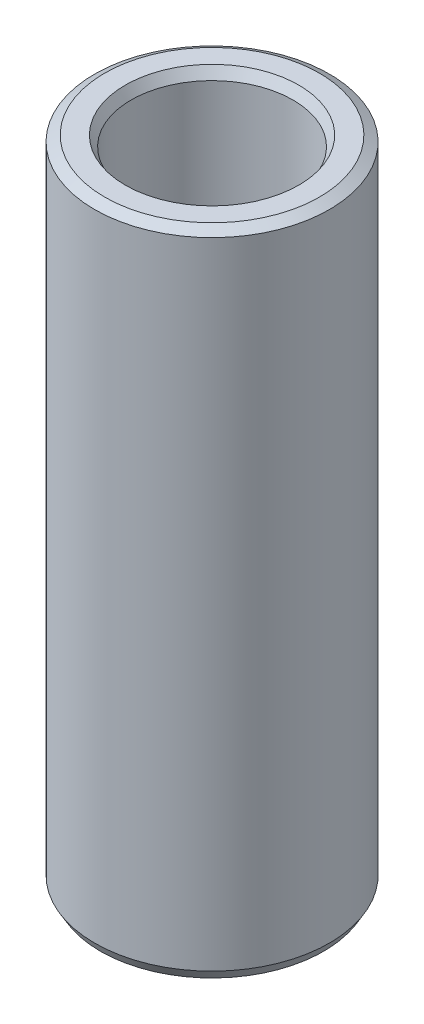
ISO-10303-21;
HEADER;
FILE_DESCRIPTION(('STEP AP214'),'2;1');
FILE_NAME('part.step','',(''),(''),'','','');
FILE_SCHEMA(('AUTOMOTIVE_DESIGN { 1 0 10303 214 1 1 1 1 }'));
ENDSEC;
DATA;
#1=APPLICATION_CONTEXT('core data for automotive mechanical design processes');
#2=APPLICATION_PROTOCOL_DEFINITION('international standard','automotive_design',2000,#1);
#3=PRODUCT_CONTEXT('',#1,'mechanical');
#4=PRODUCT('Part','Part','',(#3));
#5=PRODUCT_RELATED_PRODUCT_CATEGORY('part','',(#4));
#6=PRODUCT_DEFINITION_FORMATION('','',#4);
#7=PRODUCT_DEFINITION_CONTEXT('part definition',#1,'design');
#8=PRODUCT_DEFINITION('design','',#6,#7);
#9=PRODUCT_DEFINITION_SHAPE('','',#8);
#10=(LENGTH_UNIT() NAMED_UNIT(*) SI_UNIT(.MILLI.,.METRE.));
#11=(NAMED_UNIT(*) PLANE_ANGLE_UNIT() SI_UNIT($,.RADIAN.));
#12=(NAMED_UNIT(*) SI_UNIT($,.STERADIAN.) SOLID_ANGLE_UNIT());
#13=UNCERTAINTY_MEASURE_WITH_UNIT(LENGTH_MEASURE(1.E-05),#10,'distance_accuracy_value','');
#14=(GEOMETRIC_REPRESENTATION_CONTEXT(3) GLOBAL_UNCERTAINTY_ASSIGNED_CONTEXT((#13)) GLOBAL_UNIT_ASSIGNED_CONTEXT((#10,
#11,#12)) REPRESENTATION_CONTEXT('',''));
#15=CARTESIAN_POINT('',(0.,0.,0.));
#16=DIRECTION('',(0.,0.,1.));
#17=DIRECTION('',(1.,0.,0.));
#18=AXIS2_PLACEMENT_3D('',#15,#16,#17);
#19=CARTESIAN_POINT('',(0.,318.869293218978,0.));
#20=DIRECTION('',(0.,-1.,0.));
#21=DIRECTION('',(0.,0.,-1.));
#22=AXIS2_PLACEMENT_3D('',#19,#20,#21);
#23=CYLINDRICAL_SURFACE('',#22,57.5);
#24=CARTESIAN_POINT('',(0.,4.9073877199623,0.));
#25=DIRECTION('',(0.,1.,0.));
#26=DIRECTION('',(0.,0.,1.));
#27=AXIS2_PLACEMENT_3D('',#24,#25,#26);
#28=CIRCLE('',#27,57.5);
#29=CARTESIAN_POINT('',(0.,4.9073877199623,57.5));
#30=VERTEX_POINT('',#29);
#31=EDGE_CURVE('E10',#30,#30,#28,.T.);
#32=ORIENTED_EDGE('',*,*,#31,.T.);
#33=EDGE_LOOP('',(#32));
#34=FACE_BOUND('',#33,.T.);
#35=CARTESIAN_POINT('',(0.,316.03601159784,0.));
#36=DIRECTION('',(0.,1.,0.));
#37=DIRECTION('',(0.,0.,1.));
#38=AXIS2_PLACEMENT_3D('',#35,#36,#37);
#39=CIRCLE('',#38,57.5);
#40=CARTESIAN_POINT('',(0.,316.03601159784,57.5));
#41=VERTEX_POINT('',#40);
#42=EDGE_CURVE('E50',#41,#41,#39,.F.);
#43=ORIENTED_EDGE('',*,*,#42,.T.);
#44=EDGE_LOOP('',(#43));
#45=FACE_BOUND('',#44,.T.);
#46=ADVANCED_FACE('F39',(#34,#45),#23,.T.);
#47=CARTESIAN_POINT('',(0.,318.869293218978,0.));
#48=DIRECTION('',(0.,1.,0.));
#49=DIRECTION('',(0.,0.,1.));
#50=AXIS2_PLACEMENT_3D('',#47,#48,#49);
#51=PLANE('',#50);
#52=CARTESIAN_POINT('',(0.,318.869293218978,0.));
#53=DIRECTION('',(0.,1.,0.));
#54=DIRECTION('',(0.,0.,1.));
#55=AXIS2_PLACEMENT_3D('',#52,#53,#54);
#56=CIRCLE('',#55,42.4833806320961);
#57=CARTESIAN_POINT('',(0.,318.869293218978,42.4833806320961));
#58=VERTEX_POINT('',#57);
#59=EDGE_CURVE('E58',#58,#58,#56,.F.);
#60=ORIENTED_EDGE('',*,*,#59,.T.);
#61=EDGE_LOOP('',(#60));
#62=FACE_BOUND('',#61,.T.);
#63=CARTESIAN_POINT('',(0.,318.869293218978,0.));
#64=DIRECTION('',(0.,1.,0.));
#65=DIRECTION('',(0.,0.,1.));
#66=AXIS2_PLACEMENT_3D('',#63,#64,#65);
#67=CIRCLE('',#66,52.5926122800376);
#68=CARTESIAN_POINT('',(0.,318.869293218978,52.5926122800376));
#69=VERTEX_POINT('',#68);
#70=EDGE_CURVE('E61',#69,#69,#67,.T.);
#71=ORIENTED_EDGE('',*,*,#70,.T.);
#72=EDGE_LOOP('',(#71));
#73=FACE_BOUND('',#72,.T.);
#74=ADVANCED_FACE('F88',(#62,#73),#51,.T.);
#75=CARTESIAN_POINT('',(0.,0.,0.));
#76=DIRECTION('',(0.,1.,0.));
#77=DIRECTION('',(0.,0.,1.));
#78=AXIS2_PLACEMENT_3D('',#75,#76,#77);
#79=PLANE('',#78);
#80=CARTESIAN_POINT('',(0.,0.,0.));
#81=DIRECTION('',(0.,1.,0.));
#82=DIRECTION('',(0.,0.,1.));
#83=AXIS2_PLACEMENT_3D('',#80,#81,#82);
#84=CIRCLE('',#83,44.5574867309204);
#85=CARTESIAN_POINT('',(0.,0.,-44.5574867309204));
#86=VERTEX_POINT('',#85);
#87=EDGE_CURVE('E51',#86,#86,#84,.T.);
#88=ORIENTED_EDGE('',*,*,#87,.T.);
#89=EDGE_LOOP('',(#88));
#90=FACE_BOUND('',#89,.T.);
#91=CARTESIAN_POINT('',(0.,0.,0.));
#92=DIRECTION('',(0.,1.,0.));
#93=DIRECTION('',(0.,0.,1.));
#94=AXIS2_PLACEMENT_3D('',#91,#92,#93);
#95=CIRCLE('',#94,54.6667183788619);
#96=CARTESIAN_POINT('',(0.,0.,54.6667183788619));
#97=VERTEX_POINT('',#96);
#98=EDGE_CURVE('E54',#97,#97,#95,.F.);
#99=ORIENTED_EDGE('',*,*,#98,.T.);
#100=EDGE_LOOP('',(#99));
#101=FACE_BOUND('',#100,.T.);
#102=ADVANCED_FACE('F83',(#90,#101),#79,.F.);
#103=CARTESIAN_POINT('',(0.,318.869293218978,0.));
#104=DIRECTION('',(0.,-1.,0.));
#105=DIRECTION('',(0.,0.,-1.));
#106=AXIS2_PLACEMENT_3D('',#103,#104,#105);
#107=CYLINDRICAL_SURFACE('',#106,39.650099010958);
#108=CARTESIAN_POINT('',(0.,313.961905499016,0.));
#109=DIRECTION('',(0.,1.,0.));
#110=DIRECTION('',(0.,0.,1.));
#111=AXIS2_PLACEMENT_3D('',#108,#109,#110);
#112=CIRCLE('',#111,39.650099010958);
#113=CARTESIAN_POINT('',(0.,313.961905499016,39.650099010958));
#114=VERTEX_POINT('',#113);
#115=EDGE_CURVE('E67',#114,#114,#112,.T.);
#116=ORIENTED_EDGE('',*,*,#115,.T.);
#117=EDGE_LOOP('',(#116));
#118=FACE_BOUND('',#117,.T.);
#119=CARTESIAN_POINT('',(0.,2.83328162113811,0.));
#120=DIRECTION('',(0.,1.,0.));
#121=DIRECTION('',(0.,0.,1.));
#122=AXIS2_PLACEMENT_3D('',#119,#120,#121);
#123=CIRCLE('',#122,39.650099010958);
#124=CARTESIAN_POINT('',(0.,2.83328162113811,-39.650099010958));
#125=VERTEX_POINT('',#124);
#126=EDGE_CURVE('E69',#125,#125,#123,.F.);
#127=ORIENTED_EDGE('',*,*,#126,.T.);
#128=EDGE_LOOP('',(#127));
#129=FACE_BOUND('',#128,.T.);
#130=ADVANCED_FACE('F71',(#118,#129),#107,.F.);
#131=CARTESIAN_POINT('',(0.,313.961905499016,0.));
#132=DIRECTION('',(0.,1.,0.));
#133=DIRECTION('',(0.,0.,1.));
#134=AXIS2_PLACEMENT_3D('',#131,#132,#133);
#135=CONICAL_SURFACE('',#134,39.650099010958,0.523598775598301);
#136=ORIENTED_EDGE('',*,*,#59,.F.);
#137=EDGE_LOOP('',(#136));
#138=FACE_BOUND('',#137,.T.);
#139=ORIENTED_EDGE('',*,*,#115,.F.);
#140=EDGE_LOOP('',(#139));
#141=FACE_BOUND('',#140,.T.);
#142=ADVANCED_FACE('F77',(#138,#141),#135,.F.);
#143=CARTESIAN_POINT('',(0.,0.,0.));
#144=DIRECTION('',(0.,-1.,0.));
#145=DIRECTION('',(0.,0.,-1.));
#146=AXIS2_PLACEMENT_3D('',#143,#144,#145);
#147=CONICAL_SURFACE('',#146,44.5574867309204,1.0471975511966);
#148=CARTESIAN_POINT('',(0.,2.83328162113811,-39.650099010958));
#149=CARTESIAN_POINT('',(0.,2.80376827091792,-39.701217633041));
#150=CARTESIAN_POINT('',(0.,2.77425492069773,-39.7523362551239));
#151=CARTESIAN_POINT('',(0.,2.71522822025735,-39.8545734992898));
#152=CARTESIAN_POINT('',(0.,2.68571487003716,-39.9056921213727));
#153=CARTESIAN_POINT('',(0.,2.62668816959679,-40.0079293655386));
#154=CARTESIAN_POINT('',(0.,2.5971748193766,-40.0590479876216));
#155=CARTESIAN_POINT('',(0.,2.53814811893622,-40.1612852317874));
#156=CARTESIAN_POINT('',(0.,2.50863476871603,-40.2124038538704));
#157=CARTESIAN_POINT('',(0.,2.44960806827565,-40.3146410980363));
#158=CARTESIAN_POINT('',(0.,2.42009471805547,-40.3657597201192));
#159=CARTESIAN_POINT('',(0.,2.36106801761509,-40.4679969642851));
#160=CARTESIAN_POINT('',(0.,2.3315546673949,-40.519115586368));
#161=CARTESIAN_POINT('',(0.,2.27252796695452,-40.6213528305339));
#162=CARTESIAN_POINT('',(0.,2.24301461673433,-40.6724714526168));
#163=CARTESIAN_POINT('',(0.,2.18398791629396,-40.7747086967827));
#164=CARTESIAN_POINT('',(0.,2.15447456607377,-40.8258273188657));
#165=CARTESIAN_POINT('',(0.,2.09544786563339,-40.9280645630316));
#166=CARTESIAN_POINT('',(0.,2.0659345154132,-40.9791831851145));
#167=CARTESIAN_POINT('',(0.,2.00690781497282,-41.0814204292804));
#168=CARTESIAN_POINT('',(0.,1.97739446475264,-41.1325390513633));
#169=CARTESIAN_POINT('',(0.,1.91836776431226,-41.2347762955292));
#170=CARTESIAN_POINT('',(0.,1.88885441409207,-41.2858949176121));
#171=CARTESIAN_POINT('',(0.,1.82982771365169,-41.388132161778));
#172=CARTESIAN_POINT('',(0.,1.8003143634315,-41.439250783861));
#173=CARTESIAN_POINT('',(0.,1.74128766299113,-41.5414880280268));
#174=CARTESIAN_POINT('',(0.,1.71177431277094,-41.5926066501098));
#175=CARTESIAN_POINT('',(0.,1.65274761233056,-41.6948438942757));
#176=CARTESIAN_POINT('',(0.,1.62323426211037,-41.7459625163586));
#177=CARTESIAN_POINT('',(0.,1.56420756167,-41.8481997605245));
#178=CARTESIAN_POINT('',(0.,1.53469421144981,-41.8993183826074));
#179=CARTESIAN_POINT('',(0.,1.47566751100943,-42.0015556267733));
#180=CARTESIAN_POINT('',(0.,1.44615416078924,-42.0526742488563));
#181=CARTESIAN_POINT('',(0.,1.38712746034886,-42.1549114930221));
#182=CARTESIAN_POINT('',(0.,1.35761411012868,-42.2060301151051));
#183=CARTESIAN_POINT('',(0.,1.2985874096883,-42.308267359271));
#184=CARTESIAN_POINT('',(0.,1.26907405946811,-42.3593859813539));
#185=CARTESIAN_POINT('',(0.,1.21004735902773,-42.4616232255198));
#186=CARTESIAN_POINT('',(0.,1.18053400880754,-42.5127418476027));
#187=CARTESIAN_POINT('',(0.,1.12150730836717,-42.6149790917686));
#188=CARTESIAN_POINT('',(0.,1.09199395814698,-42.6660977138515));
#189=CARTESIAN_POINT('',(0.,1.0329672577066,-42.7683349580174));
#190=CARTESIAN_POINT('',(0.,1.00345390748641,-42.8194535801004));
#191=CARTESIAN_POINT('',(0.,0.944427207046035,-42.9216908242662));
#192=CARTESIAN_POINT('',(0.,0.914913856825847,-42.9728094463492));
#193=CARTESIAN_POINT('',(0.,0.85588715638547,-43.0750466905151));
#194=CARTESIAN_POINT('',(0.,0.826373806165281,-43.126165312598));
#195=CARTESIAN_POINT('',(0.,0.767347105724904,-43.2284025567639));
#196=CARTESIAN_POINT('',(0.,0.737833755504715,-43.2795211788468));
#197=CARTESIAN_POINT('',(0.,0.678807055064338,-43.3817584230127));
#198=CARTESIAN_POINT('',(0.,0.649293704844149,-43.4328770450957));
#199=CARTESIAN_POINT('',(0.,0.590267004403772,-43.5351142892615));
#200=CARTESIAN_POINT('',(0.,0.560753654183584,-43.5862329113445));
#201=CARTESIAN_POINT('',(0.,0.501726953743207,-43.6884701555104));
#202=CARTESIAN_POINT('',(0.,0.472213603523017,-43.7395887775933));
#203=CARTESIAN_POINT('',(0.,0.41318690308264,-43.8418260217592));
#204=CARTESIAN_POINT('',(0.,0.383673552862452,-43.8929446438421));
#205=CARTESIAN_POINT('',(0.,0.324646852422075,-43.995181888008));
#206=CARTESIAN_POINT('',(0.,0.295133502201886,-44.0463005100909));
#207=CARTESIAN_POINT('',(0.,0.236106801761509,-44.1485377542568));
#208=CARTESIAN_POINT('',(0.,0.20659345154132,-44.1996563763398));
#209=CARTESIAN_POINT('',(0.,0.147566751100943,-44.3018936205057));
#210=CARTESIAN_POINT('',(0.,0.118053400880754,-44.3530122425886));
#211=CARTESIAN_POINT('',(0.,0.0590267004403772,-44.4552494867545));
#212=CARTESIAN_POINT('',(0.,0.0295133502201885,-44.5063681088374));
#213=CARTESIAN_POINT('',(0.,0.,-44.5574867309204));
#214=B_SPLINE_CURVE_WITH_KNOTS('',3,(#148,#149,#150,#151,#152,#153,#154,#155,#156,#157,#158,
#159,#160,#161,#162,#163,#164,#165,#166,#167,#168,#169,#170,#171,#172,#173,#174,#175,#176,#177,
#178,#179,#180,#181,#182,#183,#184,#185,#186,#187,#188,#189,#190,#191,#192,#193,#194,#195,#196,
#197,#198,#199,#200,#201,#202,#203,#204,#205,#206,#207,#208,#209,#210,#211,#212,#213),
.UNSPECIFIED.,.F.,.F.,(4,2,2,2,2,2,2,2,2,2,2,2,2,2,2,2,2,2,2,2,2,2,2,2,2,2,2,2,2,2,2,2,4),(0.,
0.177080101321133,0.354160202642265,0.531240303963398,0.708320405284531,0.885400506605663,
1.06248060792679,1.23956070924792,1.41664081056906,1.59372091189019,1.77080101321132,
1.94788111453245,2.12496121585359,2.30204131717472,2.47912141849585,2.65620151981698,
2.83328162113812,3.01036172245924,3.18744182378038,3.36452192510151,3.54160202642264,
3.71868212774377,3.89576222906491,4.07284233038604,4.24992243170717,4.4270025330283,
4.60408263434944,4.78116273567056,4.95824283699169,5.13532293831283,5.31240303963396,
5.48948314095509,5.66656324227622),.UNSPECIFIED.);
#215=EDGE_CURVE('BSEAM73',#125,#86,#214,.T.);
#216=ORIENTED_EDGE('',*,*,#126,.F.);
#217=ORIENTED_EDGE('',*,*,#87,.F.);
#218=ORIENTED_EDGE('',*,*,#215,.T.);
#219=ORIENTED_EDGE('',*,*,#215,.F.);
#220=EDGE_LOOP('',(#216,#218,#217,#219));
#221=FACE_BOUND('',#220,.T.);
#222=ADVANCED_FACE('F73',(#221),#147,.F.);
#223=CARTESIAN_POINT('',(0.,4.9073877199623,0.));
#224=DIRECTION('',(0.,1.,0.));
#225=DIRECTION('',(0.,0.,1.));
#226=AXIS2_PLACEMENT_3D('',#223,#224,#225);
#227=CONICAL_SURFACE('',#226,57.5,0.523598775598304);
#228=ORIENTED_EDGE('',*,*,#98,.F.);
#229=EDGE_LOOP('',(#228));
#230=FACE_BOUND('',#229,.T.);
#231=ORIENTED_EDGE('',*,*,#31,.F.);
#232=EDGE_LOOP('',(#231));
#233=FACE_BOUND('',#232,.T.);
#234=ADVANCED_FACE('F76',(#230,#233),#227,.T.);
#235=CARTESIAN_POINT('',(0.,318.869293218978,0.));
#236=DIRECTION('',(0.,-1.,0.));
#237=DIRECTION('',(0.,0.,-1.));
#238=AXIS2_PLACEMENT_3D('',#235,#236,#237);
#239=CONICAL_SURFACE('',#238,52.5926122800376,1.04719755119659);
#240=ORIENTED_EDGE('',*,*,#42,.F.);
#241=EDGE_LOOP('',(#240));
#242=FACE_BOUND('',#241,.T.);
#243=ORIENTED_EDGE('',*,*,#70,.F.);
#244=EDGE_LOOP('',(#243));
#245=FACE_BOUND('',#244,.T.);
#246=ADVANCED_FACE('F45',(#242,#245),#239,.T.);
#247=CLOSED_SHELL('',(#46,#74,#102,#130,#142,#222,#234,#246));
#248=MANIFOLD_SOLID_BREP('B2',#247);
#249=ADVANCED_BREP_SHAPE_REPRESENTATION('',(#18,#248),#14);
#250=SHAPE_DEFINITION_REPRESENTATION(#9,#249);
ENDSEC;
END-ISO-10303-21;
